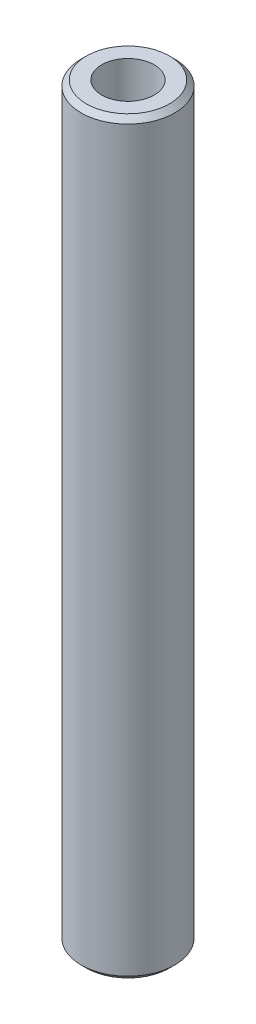
ISO-10303-21;
HEADER;
FILE_DESCRIPTION(('STEP AP214'),'2;1');
FILE_NAME('part.step','',(''),(''),'','','');
FILE_SCHEMA(('AUTOMOTIVE_DESIGN { 1 0 10303 214 1 1 1 1 }'));
ENDSEC;
DATA;
#1=APPLICATION_CONTEXT('core data for automotive mechanical design processes');
#2=APPLICATION_PROTOCOL_DEFINITION('international standard','automotive_design',2000,#1);
#3=PRODUCT_CONTEXT('',#1,'mechanical');
#4=PRODUCT('Part','Part','',(#3));
#5=PRODUCT_RELATED_PRODUCT_CATEGORY('part','',(#4));
#6=PRODUCT_DEFINITION_FORMATION('','',#4);
#7=PRODUCT_DEFINITION_CONTEXT('part definition',#1,'design');
#8=PRODUCT_DEFINITION('design','',#6,#7);
#9=PRODUCT_DEFINITION_SHAPE('','',#8);
#10=(LENGTH_UNIT() NAMED_UNIT(*) SI_UNIT(.MILLI.,.METRE.));
#11=(NAMED_UNIT(*) PLANE_ANGLE_UNIT() SI_UNIT($,.RADIAN.));
#12=(NAMED_UNIT(*) SI_UNIT($,.STERADIAN.) SOLID_ANGLE_UNIT());
#13=UNCERTAINTY_MEASURE_WITH_UNIT(LENGTH_MEASURE(1.E-05),#10,'distance_accuracy_value','');
#14=(GEOMETRIC_REPRESENTATION_CONTEXT(3) GLOBAL_UNCERTAINTY_ASSIGNED_CONTEXT((#13)) GLOBAL_UNIT_ASSIGNED_CONTEXT((#10,
#11,#12)) REPRESENTATION_CONTEXT('',''));
#15=CARTESIAN_POINT('',(0.,0.,0.));
#16=DIRECTION('',(0.,0.,1.));
#17=DIRECTION('',(1.,0.,0.));
#18=AXIS2_PLACEMENT_3D('',#15,#16,#17);
#19=CARTESIAN_POINT('',(0.,600.,0.));
#20=DIRECTION('',(0.,-1.,0.));
#21=DIRECTION('',(0.,0.,-1.));
#22=AXIS2_PLACEMENT_3D('',#19,#20,#21);
#23=CYLINDRICAL_SURFACE('',#22,37.5);
#24=CARTESIAN_POINT('',(0.,595.79446583121,0.));
#25=DIRECTION('',(0.,1.,0.));
#26=DIRECTION('',(0.,0.,1.));
#27=AXIS2_PLACEMENT_3D('',#24,#25,#26);
#28=CIRCLE('',#27,37.5);
#29=CARTESIAN_POINT('',(0.,595.79446583121,37.5));
#30=VERTEX_POINT('',#29);
#31=EDGE_CURVE('E50',#30,#30,#28,.F.);
#32=ORIENTED_EDGE('',*,*,#31,.T.);
#33=EDGE_LOOP('',(#32));
#34=FACE_BOUND('',#33,.T.);
#35=CARTESIAN_POINT('',(0.,4.20553416878988,0.));
#36=DIRECTION('',(0.,1.,0.));
#37=DIRECTION('',(0.,0.,1.));
#38=AXIS2_PLACEMENT_3D('',#35,#36,#37);
#39=CIRCLE('',#38,37.5);
#40=CARTESIAN_POINT('',(0.,4.20553416878988,37.5));
#41=VERTEX_POINT('',#40);
#42=EDGE_CURVE('E51',#41,#41,#39,.T.);
#43=ORIENTED_EDGE('',*,*,#42,.T.);
#44=EDGE_LOOP('',(#43));
#45=FACE_BOUND('',#44,.T.);
#46=ADVANCED_FACE('F39',(#34,#45),#23,.T.);
#47=CARTESIAN_POINT('',(0.,600.,0.));
#48=DIRECTION('',(0.,1.,0.));
#49=DIRECTION('',(0.,0.,1.));
#50=AXIS2_PLACEMENT_3D('',#47,#48,#49);
#51=PLANE('',#50);
#52=CARTESIAN_POINT('',(0.,600.,0.));
#53=DIRECTION('',(0.,1.,0.));
#54=DIRECTION('',(0.,0.,1.));
#55=AXIS2_PLACEMENT_3D('',#52,#53,#54);
#56=CIRCLE('',#55,33.2944658312101);
#57=CARTESIAN_POINT('',(0.,600.,33.2944658312101));
#58=VERTEX_POINT('',#57);
#59=EDGE_CURVE('E54',#58,#58,#56,.T.);
#60=ORIENTED_EDGE('',*,*,#59,.T.);
#61=EDGE_LOOP('',(#60));
#62=FACE_BOUND('',#61,.T.);
#63=CARTESIAN_POINT('',(0.,600.,0.));
#64=DIRECTION('',(0.,1.,0.));
#65=DIRECTION('',(0.,0.,1.));
#66=AXIS2_PLACEMENT_3D('',#63,#64,#65);
#67=CIRCLE('',#66,21.0567081378792);
#68=CARTESIAN_POINT('',(0.,600.,21.0567081378792));
#69=VERTEX_POINT('',#68);
#70=EDGE_CURVE('E58',#69,#69,#67,.T.);
#71=ORIENTED_EDGE('',*,*,#70,.F.);
#72=EDGE_LOOP('',(#71));
#73=FACE_BOUND('',#72,.T.);
#74=ADVANCED_FACE('F69',(#62,#73),#51,.T.);
#75=CARTESIAN_POINT('',(0.,0.,0.));
#76=DIRECTION('',(0.,1.,0.));
#77=DIRECTION('',(0.,0.,1.));
#78=AXIS2_PLACEMENT_3D('',#75,#76,#77);
#79=PLANE('',#78);
#80=CARTESIAN_POINT('',(0.,0.,0.));
#81=DIRECTION('',(0.,1.,0.));
#82=DIRECTION('',(0.,0.,1.));
#83=AXIS2_PLACEMENT_3D('',#80,#81,#82);
#84=CIRCLE('',#83,33.2944658312101);
#85=CARTESIAN_POINT('',(0.,0.,33.2944658312101));
#86=VERTEX_POINT('',#85);
#87=EDGE_CURVE('E10',#86,#86,#84,.F.);
#88=ORIENTED_EDGE('',*,*,#87,.T.);
#89=EDGE_LOOP('',(#88));
#90=FACE_BOUND('',#89,.T.);
#91=CARTESIAN_POINT('',(0.,0.,0.));
#92=DIRECTION('',(0.,1.,0.));
#93=DIRECTION('',(0.,0.,1.));
#94=AXIS2_PLACEMENT_3D('',#91,#92,#93);
#95=CIRCLE('',#94,21.0567081378792);
#96=CARTESIAN_POINT('',(0.,0.,21.0567081378792));
#97=VERTEX_POINT('',#96);
#98=EDGE_CURVE('E63',#97,#97,#95,.T.);
#99=ORIENTED_EDGE('',*,*,#98,.T.);
#100=EDGE_LOOP('',(#99));
#101=FACE_BOUND('',#100,.T.);
#102=ADVANCED_FACE('F75',(#90,#101),#79,.F.);
#103=CARTESIAN_POINT('',(0.,600.,0.));
#104=DIRECTION('',(0.,-1.,0.));
#105=DIRECTION('',(0.,0.,-1.));
#106=AXIS2_PLACEMENT_3D('',#103,#104,#105);
#107=CYLINDRICAL_SURFACE('',#106,21.0567081378792);
#108=ORIENTED_EDGE('',*,*,#70,.T.);
#109=EDGE_LOOP('',(#108));
#110=FACE_BOUND('',#109,.T.);
#111=ORIENTED_EDGE('',*,*,#98,.F.);
#112=EDGE_LOOP('',(#111));
#113=FACE_BOUND('',#112,.T.);
#114=ADVANCED_FACE('F70',(#110,#113),#107,.F.);
#115=CARTESIAN_POINT('',(0.,600.,0.));
#116=DIRECTION('',(0.,-1.,0.));
#117=DIRECTION('',(0.,0.,-1.));
#118=AXIS2_PLACEMENT_3D('',#115,#116,#117);
#119=CONICAL_SURFACE('',#118,33.2944658312101,0.785398163397425);
#120=ORIENTED_EDGE('',*,*,#31,.F.);
#121=EDGE_LOOP('',(#120));
#122=FACE_BOUND('',#121,.T.);
#123=ORIENTED_EDGE('',*,*,#59,.F.);
#124=EDGE_LOOP('',(#123));
#125=FACE_BOUND('',#124,.T.);
#126=ADVANCED_FACE('F81',(#122,#125),#119,.T.);
#127=CARTESIAN_POINT('',(0.,4.20553416878988,0.));
#128=DIRECTION('',(0.,1.,0.));
#129=DIRECTION('',(0.,0.,1.));
#130=AXIS2_PLACEMENT_3D('',#127,#128,#129);
#131=CONICAL_SURFACE('',#130,37.5,0.785398163397452);
#132=ORIENTED_EDGE('',*,*,#87,.F.);
#133=EDGE_LOOP('',(#132));
#134=FACE_BOUND('',#133,.T.);
#135=ORIENTED_EDGE('',*,*,#42,.F.);
#136=EDGE_LOOP('',(#135));
#137=FACE_BOUND('',#136,.T.);
#138=ADVANCED_FACE('F45',(#134,#137),#131,.T.);
#139=CLOSED_SHELL('',(#46,#74,#102,#114,#126,#138));
#140=MANIFOLD_SOLID_BREP('B2',#139);
#141=ADVANCED_BREP_SHAPE_REPRESENTATION('',(#18,#140),#14);
#142=SHAPE_DEFINITION_REPRESENTATION(#9,#141);
ENDSEC;
END-ISO-10303-21;
